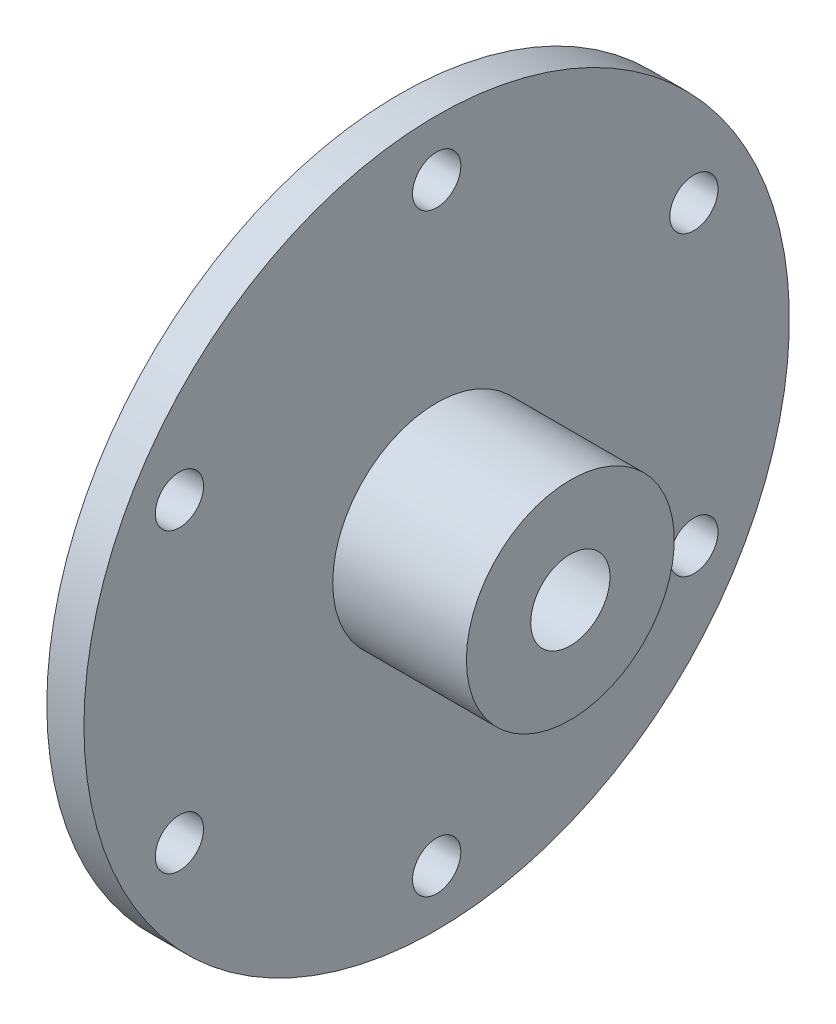
ISO-10303-21;
HEADER;
FILE_DESCRIPTION(('STEP AP214'),'2;1');
FILE_NAME('part.step','',(''),(''),'','','');
FILE_SCHEMA(('AUTOMOTIVE_DESIGN { 1 0 10303 214 1 1 1 1 }'));
ENDSEC;
DATA;
#1=APPLICATION_CONTEXT('core data for automotive mechanical design processes');
#2=APPLICATION_PROTOCOL_DEFINITION('international standard','automotive_design',2000,#1);
#3=PRODUCT_CONTEXT('',#1,'mechanical');
#4=PRODUCT('Part','Part','',(#3));
#5=PRODUCT_RELATED_PRODUCT_CATEGORY('part','',(#4));
#6=PRODUCT_DEFINITION_FORMATION('','',#4);
#7=PRODUCT_DEFINITION_CONTEXT('part definition',#1,'design');
#8=PRODUCT_DEFINITION('design','',#6,#7);
#9=PRODUCT_DEFINITION_SHAPE('','',#8);
#10=(LENGTH_UNIT() NAMED_UNIT(*) SI_UNIT(.MILLI.,.METRE.));
#11=(NAMED_UNIT(*) PLANE_ANGLE_UNIT() SI_UNIT($,.RADIAN.));
#12=(NAMED_UNIT(*) SI_UNIT($,.STERADIAN.) SOLID_ANGLE_UNIT());
#13=UNCERTAINTY_MEASURE_WITH_UNIT(LENGTH_MEASURE(1.E-05),#10,'distance_accuracy_value','');
#14=(GEOMETRIC_REPRESENTATION_CONTEXT(3) GLOBAL_UNCERTAINTY_ASSIGNED_CONTEXT((#13)) GLOBAL_UNIT_ASSIGNED_CONTEXT((#10,
#11,#12)) REPRESENTATION_CONTEXT('',''));
#15=CARTESIAN_POINT('',(0.,0.,0.));
#16=DIRECTION('',(0.,0.,1.));
#17=DIRECTION('',(1.,0.,0.));
#18=AXIS2_PLACEMENT_3D('',#15,#16,#17);
#19=CARTESIAN_POINT('',(-20.0253164556962,0.,0.));
#20=DIRECTION('',(1.,0.,0.));
#21=DIRECTION('',(0.,0.,-1.));
#22=AXIS2_PLACEMENT_3D('',#19,#20,#21);
#23=PLANE('',#22);
#24=CARTESIAN_POINT('',(-20.0253164556962,0.,0.));
#25=DIRECTION('',(-1.,0.,0.));
#26=DIRECTION('',(0.,0.,1.));
#27=AXIS2_PLACEMENT_3D('',#24,#25,#26);
#28=CIRCLE('',#27,13.);
#29=CARTESIAN_POINT('',(-20.0253164556962,0.,13.));
#30=VERTEX_POINT('',#29);
#31=EDGE_CURVE('E99',#30,#30,#28,.T.);
#32=ORIENTED_EDGE('',*,*,#31,.F.);
#33=EDGE_LOOP('',(#32));
#34=FACE_BOUND('',#33,.T.);
#35=CARTESIAN_POINT('',(-20.0253164556962,0.,0.));
#36=DIRECTION('',(-1.,0.,0.));
#37=DIRECTION('',(0.,0.,1.));
#38=AXIS2_PLACEMENT_3D('',#35,#36,#37);
#39=CIRCLE('',#38,35.);
#40=CARTESIAN_POINT('',(-20.0253164556962,0.,35.));
#41=VERTEX_POINT('',#40);
#42=EDGE_CURVE('E10',#41,#41,#39,.T.);
#43=ORIENTED_EDGE('',*,*,#42,.T.);
#44=EDGE_LOOP('',(#43));
#45=FACE_BOUND('',#44,.T.);
#46=ADVANCED_FACE('F41',(#34,#45),#23,.F.);
#47=CARTESIAN_POINT('',(-20.0253164556962,0.,0.));
#48=DIRECTION('',(-1.,0.,0.));
#49=DIRECTION('',(0.,0.,1.));
#50=AXIS2_PLACEMENT_3D('',#47,#48,#49);
#51=CYLINDRICAL_SURFACE('',#50,35.);
#52=ORIENTED_EDGE('',*,*,#42,.F.);
#53=EDGE_LOOP('',(#52));
#54=FACE_BOUND('',#53,.T.);
#55=CARTESIAN_POINT('',(-15.0253164556962,0.,0.));
#56=DIRECTION('',(-1.,0.,0.));
#57=DIRECTION('',(0.,0.,1.));
#58=AXIS2_PLACEMENT_3D('',#55,#56,#57);
#59=CIRCLE('',#58,35.);
#60=CARTESIAN_POINT('',(-15.0253164556962,0.,35.));
#61=VERTEX_POINT('',#60);
#62=EDGE_CURVE('E48',#61,#61,#59,.T.);
#63=ORIENTED_EDGE('',*,*,#62,.T.);
#64=EDGE_LOOP('',(#63));
#65=FACE_BOUND('',#64,.T.);
#66=ADVANCED_FACE('F149',(#54,#65),#51,.T.);
#67=CARTESIAN_POINT('',(-15.0253164556962,35.,0.));
#68=DIRECTION('',(1.,0.,0.));
#69=DIRECTION('',(0.,0.,-1.));
#70=AXIS2_PLACEMENT_3D('',#67,#68,#69);
#71=PLANE('',#70);
#72=CARTESIAN_POINT('',(-15.0253164556962,20.0000000000004,34.6410161513773));
#73=DIRECTION('',(1.,0.,0.));
#74=DIRECTION('',(0.,0.,-1.));
#75=AXIS2_PLACEMENT_3D('',#72,#73,#74);
#76=CIRCLE('',#75,3.24999999999999);
#77=CARTESIAN_POINT('',(-15.0253164556962,20.0000000000004,31.3910161513773));
#78=VERTEX_POINT('',#77);
#79=EDGE_CURVE('E44',#78,#78,#76,.T.);
#80=ORIENTED_EDGE('',*,*,#79,.T.);
#81=EDGE_LOOP('',(#80));
#82=FACE_BOUND('',#81,.T.);
#83=CARTESIAN_POINT('',(-15.0253164556962,-19.9999999999997,34.6410161513777));
#84=DIRECTION('',(1.,0.,0.));
#85=DIRECTION('',(0.,0.,-1.));
#86=AXIS2_PLACEMENT_3D('',#83,#84,#85);
#87=CIRCLE('',#86,3.24999999999999);
#88=CARTESIAN_POINT('',(-15.0253164556962,-19.9999999999997,31.3910161513777));
#89=VERTEX_POINT('',#88);
#90=EDGE_CURVE('E78',#89,#89,#87,.T.);
#91=ORIENTED_EDGE('',*,*,#90,.T.);
#92=EDGE_LOOP('',(#91));
#93=FACE_BOUND('',#92,.T.);
#94=CARTESIAN_POINT('',(-15.0253164556962,-40.,0.));
#95=DIRECTION('',(1.,0.,0.));
#96=DIRECTION('',(0.,0.,-1.));
#97=AXIS2_PLACEMENT_3D('',#94,#95,#96);
#98=CIRCLE('',#97,3.25);
#99=CARTESIAN_POINT('',(-15.0253164556962,-40.,-3.25));
#100=VERTEX_POINT('',#99);
#101=EDGE_CURVE('E75',#100,#100,#98,.T.);
#102=ORIENTED_EDGE('',*,*,#101,.T.);
#103=EDGE_LOOP('',(#102));
#104=FACE_BOUND('',#103,.T.);
#105=CARTESIAN_POINT('',(-15.0253164556962,-20.0000000000002,-34.6410161513775));
#106=DIRECTION('',(1.,0.,0.));
#107=DIRECTION('',(0.,0.,-1.));
#108=AXIS2_PLACEMENT_3D('',#105,#106,#107);
#109=CIRCLE('',#108,3.24999999999999);
#110=CARTESIAN_POINT('',(-15.0253164556962,-20.0000000000002,-37.8910161513775));
#111=VERTEX_POINT('',#110);
#112=EDGE_CURVE('E71',#111,#111,#109,.T.);
#113=ORIENTED_EDGE('',*,*,#112,.T.);
#114=EDGE_LOOP('',(#113));
#115=FACE_BOUND('',#114,.T.);
#116=CARTESIAN_POINT('',(-15.0253164556962,19.9999999999999,-34.6410161513776));
#117=DIRECTION('',(1.,0.,0.));
#118=DIRECTION('',(0.,0.,-1.));
#119=AXIS2_PLACEMENT_3D('',#116,#117,#118);
#120=CIRCLE('',#119,3.24999999999999);
#121=CARTESIAN_POINT('',(-15.0253164556962,19.9999999999999,-37.8910161513776));
#122=VERTEX_POINT('',#121);
#123=EDGE_CURVE('E66',#122,#122,#120,.T.);
#124=ORIENTED_EDGE('',*,*,#123,.T.);
#125=EDGE_LOOP('',(#124));
#126=FACE_BOUND('',#125,.T.);
#127=CARTESIAN_POINT('',(-15.0253164556962,40.,0.));
#128=DIRECTION('',(1.,0.,0.));
#129=DIRECTION('',(0.,0.,-1.));
#130=AXIS2_PLACEMENT_3D('',#127,#128,#129);
#131=CIRCLE('',#130,3.25);
#132=CARTESIAN_POINT('',(-15.0253164556962,40.,-3.25));
#133=VERTEX_POINT('',#132);
#134=EDGE_CURVE('E62',#133,#133,#131,.T.);
#135=ORIENTED_EDGE('',*,*,#134,.T.);
#136=EDGE_LOOP('',(#135));
#137=FACE_BOUND('',#136,.T.);
#138=ORIENTED_EDGE('',*,*,#62,.F.);
#139=EDGE_LOOP('',(#138));
#140=FACE_BOUND('',#139,.T.);
#141=CARTESIAN_POINT('',(-15.0253164556962,0.,0.));
#142=DIRECTION('',(-1.,0.,0.));
#143=DIRECTION('',(0.,0.,1.));
#144=AXIS2_PLACEMENT_3D('',#141,#142,#143);
#145=CIRCLE('',#144,47.5);
#146=CARTESIAN_POINT('',(-15.0253164556962,0.,47.5));
#147=VERTEX_POINT('',#146);
#148=EDGE_CURVE('E53',#147,#147,#145,.T.);
#149=ORIENTED_EDGE('',*,*,#148,.T.);
#150=EDGE_LOOP('',(#149));
#151=FACE_BOUND('',#150,.T.);
#152=ADVANCED_FACE('F117',(#82,#93,#104,#115,#126,#137,#140,#151),#71,.F.);
#153=CARTESIAN_POINT('',(-20.0253164556962,0.,0.));
#154=DIRECTION('',(-1.,0.,0.));
#155=DIRECTION('',(0.,0.,1.));
#156=AXIS2_PLACEMENT_3D('',#153,#154,#155);
#157=CYLINDRICAL_SURFACE('',#156,47.5);
#158=ORIENTED_EDGE('',*,*,#148,.F.);
#159=EDGE_LOOP('',(#158));
#160=FACE_BOUND('',#159,.T.);
#161=CARTESIAN_POINT('',(-10.0253164556962,0.,0.));
#162=DIRECTION('',(-1.,0.,0.));
#163=DIRECTION('',(0.,0.,1.));
#164=AXIS2_PLACEMENT_3D('',#161,#162,#163);
#165=CIRCLE('',#164,47.5);
#166=CARTESIAN_POINT('',(-10.0253164556962,0.,47.5));
#167=VERTEX_POINT('',#166);
#168=EDGE_CURVE('E112',#167,#167,#165,.T.);
#169=ORIENTED_EDGE('',*,*,#168,.T.);
#170=EDGE_LOOP('',(#169));
#171=FACE_BOUND('',#170,.T.);
#172=ADVANCED_FACE('F119',(#160,#171),#157,.T.);
#173=CARTESIAN_POINT('',(-10.0253164556962,47.5,0.));
#174=DIRECTION('',(-1.,0.,0.));
#175=DIRECTION('',(0.,0.,1.));
#176=AXIS2_PLACEMENT_3D('',#173,#174,#175);
#177=PLANE('',#176);
#178=CARTESIAN_POINT('',(-10.0253164556962,20.0000000000004,34.6410161513773));
#179=DIRECTION('',(-1.,0.,0.));
#180=DIRECTION('',(0.,0.,1.));
#181=AXIS2_PLACEMENT_3D('',#178,#179,#180);
#182=CIRCLE('',#181,3.24999999999999);
#183=CARTESIAN_POINT('',(-10.0253164556962,20.0000000000004,37.8910161513773));
#184=VERTEX_POINT('',#183);
#185=EDGE_CURVE('E80',#184,#184,#182,.T.);
#186=ORIENTED_EDGE('',*,*,#185,.T.);
#187=EDGE_LOOP('',(#186));
#188=FACE_BOUND('',#187,.T.);
#189=CARTESIAN_POINT('',(-10.0253164556962,-19.9999999999997,34.6410161513777));
#190=DIRECTION('',(-1.,0.,0.));
#191=DIRECTION('',(0.,0.,1.));
#192=AXIS2_PLACEMENT_3D('',#189,#190,#191);
#193=CIRCLE('',#192,3.24999999999999);
#194=CARTESIAN_POINT('',(-10.0253164556962,-19.9999999999997,37.8910161513777));
#195=VERTEX_POINT('',#194);
#196=EDGE_CURVE('E77',#195,#195,#193,.T.);
#197=ORIENTED_EDGE('',*,*,#196,.T.);
#198=EDGE_LOOP('',(#197));
#199=FACE_BOUND('',#198,.T.);
#200=CARTESIAN_POINT('',(-10.0253164556962,-40.,0.));
#201=DIRECTION('',(-1.,0.,0.));
#202=DIRECTION('',(0.,0.,1.));
#203=AXIS2_PLACEMENT_3D('',#200,#201,#202);
#204=CIRCLE('',#203,3.25);
#205=CARTESIAN_POINT('',(-10.0253164556962,-40.,3.25));
#206=VERTEX_POINT('',#205);
#207=EDGE_CURVE('E74',#206,#206,#204,.T.);
#208=ORIENTED_EDGE('',*,*,#207,.T.);
#209=EDGE_LOOP('',(#208));
#210=FACE_BOUND('',#209,.T.);
#211=CARTESIAN_POINT('',(-10.0253164556962,-20.0000000000002,-34.6410161513775));
#212=DIRECTION('',(-1.,0.,0.));
#213=DIRECTION('',(0.,0.,1.));
#214=AXIS2_PLACEMENT_3D('',#211,#212,#213);
#215=CIRCLE('',#214,3.24999999999999);
#216=CARTESIAN_POINT('',(-10.0253164556962,-20.0000000000002,-31.3910161513775));
#217=VERTEX_POINT('',#216);
#218=EDGE_CURVE('E70',#217,#217,#215,.T.);
#219=ORIENTED_EDGE('',*,*,#218,.T.);
#220=EDGE_LOOP('',(#219));
#221=FACE_BOUND('',#220,.T.);
#222=CARTESIAN_POINT('',(-10.0253164556962,19.9999999999999,-34.6410161513776));
#223=DIRECTION('',(-1.,0.,0.));
#224=DIRECTION('',(0.,0.,1.));
#225=AXIS2_PLACEMENT_3D('',#222,#223,#224);
#226=CIRCLE('',#225,3.24999999999999);
#227=CARTESIAN_POINT('',(-10.0253164556962,19.9999999999999,-31.3910161513776));
#228=VERTEX_POINT('',#227);
#229=EDGE_CURVE('E67',#228,#228,#226,.T.);
#230=ORIENTED_EDGE('',*,*,#229,.T.);
#231=EDGE_LOOP('',(#230));
#232=FACE_BOUND('',#231,.T.);
#233=CARTESIAN_POINT('',(-10.0253164556962,40.,0.));
#234=DIRECTION('',(-1.,0.,0.));
#235=DIRECTION('',(0.,0.,1.));
#236=AXIS2_PLACEMENT_3D('',#233,#234,#235);
#237=CIRCLE('',#236,3.25);
#238=CARTESIAN_POINT('',(-10.0253164556962,40.,3.25));
#239=VERTEX_POINT('',#238);
#240=EDGE_CURVE('E65',#239,#239,#237,.T.);
#241=ORIENTED_EDGE('',*,*,#240,.T.);
#242=EDGE_LOOP('',(#241));
#243=FACE_BOUND('',#242,.T.);
#244=ORIENTED_EDGE('',*,*,#168,.F.);
#245=EDGE_LOOP('',(#244));
#246=FACE_BOUND('',#245,.T.);
#247=CARTESIAN_POINT('',(-10.0253164556962,0.,0.));
#248=DIRECTION('',(-1.,0.,0.));
#249=DIRECTION('',(0.,0.,1.));
#250=AXIS2_PLACEMENT_3D('',#247,#248,#249);
#251=CIRCLE('',#250,14.);
#252=CARTESIAN_POINT('',(-10.0253164556962,0.,14.));
#253=VERTEX_POINT('',#252);
#254=EDGE_CURVE('E109',#253,#253,#251,.T.);
#255=ORIENTED_EDGE('',*,*,#254,.T.);
#256=EDGE_LOOP('',(#255));
#257=FACE_BOUND('',#256,.T.);
#258=ADVANCED_FACE('F122',(#188,#199,#210,#221,#232,#243,#246,#257),#177,.F.);
#259=CARTESIAN_POINT('',(-20.0253164556962,0.,0.));
#260=DIRECTION('',(-1.,0.,0.));
#261=DIRECTION('',(0.,0.,1.));
#262=AXIS2_PLACEMENT_3D('',#259,#260,#261);
#263=CYLINDRICAL_SURFACE('',#262,14.);
#264=ORIENTED_EDGE('',*,*,#254,.F.);
#265=EDGE_LOOP('',(#264));
#266=FACE_BOUND('',#265,.T.);
#267=CARTESIAN_POINT('',(7.9746835443038,0.,0.));
#268=DIRECTION('',(-1.,0.,0.));
#269=DIRECTION('',(0.,0.,1.));
#270=AXIS2_PLACEMENT_3D('',#267,#268,#269);
#271=CIRCLE('',#270,14.);
#272=CARTESIAN_POINT('',(7.9746835443038,0.,14.));
#273=VERTEX_POINT('',#272);
#274=EDGE_CURVE('E60',#273,#273,#271,.T.);
#275=ORIENTED_EDGE('',*,*,#274,.T.);
#276=EDGE_LOOP('',(#275));
#277=FACE_BOUND('',#276,.T.);
#278=ADVANCED_FACE('F128',(#266,#277),#263,.T.);
#279=CARTESIAN_POINT('',(7.9746835443038,14.,0.));
#280=DIRECTION('',(-1.,0.,0.));
#281=DIRECTION('',(0.,0.,1.));
#282=AXIS2_PLACEMENT_3D('',#279,#280,#281);
#283=PLANE('',#282);
#284=CARTESIAN_POINT('',(7.9746835443038,0.,0.));
#285=DIRECTION('',(-1.,0.,0.));
#286=DIRECTION('',(0.,0.,1.));
#287=AXIS2_PLACEMENT_3D('',#284,#285,#286);
#288=CIRCLE('',#287,5.33572051764947);
#289=CARTESIAN_POINT('',(7.9746835443038,0.,5.33572051764947));
#290=VERTEX_POINT('',#289);
#291=EDGE_CURVE('E57',#290,#290,#288,.T.);
#292=ORIENTED_EDGE('',*,*,#291,.T.);
#293=EDGE_LOOP('',(#292));
#294=FACE_BOUND('',#293,.T.);
#295=ORIENTED_EDGE('',*,*,#274,.F.);
#296=EDGE_LOOP('',(#295));
#297=FACE_BOUND('',#296,.T.);
#298=ADVANCED_FACE('F134',(#294,#297),#283,.F.);
#299=CARTESIAN_POINT('',(6.97468354430379,0.,0.));
#300=DIRECTION('',(-1.,0.,0.));
#301=DIRECTION('',(0.,0.,1.));
#302=AXIS2_PLACEMENT_3D('',#299,#300,#301);
#303=CONICAL_SURFACE('',#302,6.99999999999999,1.02974425867665);
#304=CARTESIAN_POINT('',(6.97468354430379,0.,0.));
#305=DIRECTION('',(-1.,0.,0.));
#306=DIRECTION('',(0.,0.,1.));
#307=AXIS2_PLACEMENT_3D('',#304,#305,#306);
#308=CIRCLE('',#307,6.99999999999999);
#309=CARTESIAN_POINT('',(6.97468354430379,0.,6.99999999999999));
#310=VERTEX_POINT('',#309);
#311=EDGE_CURVE('E61',#310,#310,#308,.T.);
#312=ORIENTED_EDGE('',*,*,#311,.T.);
#313=EDGE_LOOP('',(#312));
#314=FACE_BOUND('',#313,.T.);
#315=ORIENTED_EDGE('',*,*,#291,.F.);
#316=EDGE_LOOP('',(#315));
#317=FACE_BOUND('',#316,.T.);
#318=ADVANCED_FACE('F139',(#314,#317),#303,.F.);
#319=CARTESIAN_POINT('',(-20.0253164556962,0.,0.));
#320=DIRECTION('',(-1.,0.,0.));
#321=DIRECTION('',(0.,0.,1.));
#322=AXIS2_PLACEMENT_3D('',#319,#320,#321);
#323=CYLINDRICAL_SURFACE('',#322,6.99999999999999);
#324=ORIENTED_EDGE('',*,*,#311,.F.);
#325=EDGE_LOOP('',(#324));
#326=FACE_BOUND('',#325,.T.);
#327=CARTESIAN_POINT('',(-14.0253164556962,0.,0.));
#328=DIRECTION('',(-1.,0.,0.));
#329=DIRECTION('',(0.,0.,1.));
#330=AXIS2_PLACEMENT_3D('',#327,#328,#329);
#331=CIRCLE('',#330,7.);
#332=CARTESIAN_POINT('',(-14.0253164556962,0.,7.));
#333=VERTEX_POINT('',#332);
#334=EDGE_CURVE('E102',#333,#333,#331,.T.);
#335=ORIENTED_EDGE('',*,*,#334,.T.);
#336=EDGE_LOOP('',(#335));
#337=FACE_BOUND('',#336,.T.);
#338=ADVANCED_FACE('F145',(#326,#337),#323,.F.);
#339=CARTESIAN_POINT('',(-20.0253164556962,0.,0.));
#340=DIRECTION('',(-1.,0.,0.));
#341=DIRECTION('',(0.,0.,1.));
#342=AXIS2_PLACEMENT_3D('',#339,#340,#341);
#343=CONICAL_SURFACE('',#342,13.,0.785398163397449);
#344=ORIENTED_EDGE('',*,*,#334,.F.);
#345=EDGE_LOOP('',(#344));
#346=FACE_BOUND('',#345,.T.);
#347=ORIENTED_EDGE('',*,*,#31,.T.);
#348=EDGE_LOOP('',(#347));
#349=FACE_BOUND('',#348,.T.);
#350=ADVANCED_FACE('F157',(#346,#349),#343,.F.);
#351=CARTESIAN_POINT('',(-20.0253164556962,40.,0.));
#352=DIRECTION('',(-1.,0.,0.));
#353=DIRECTION('',(0.,0.,1.));
#354=AXIS2_PLACEMENT_3D('',#351,#352,#353);
#355=CYLINDRICAL_SURFACE('',#354,3.25);
#356=ORIENTED_EDGE('',*,*,#134,.F.);
#357=EDGE_LOOP('',(#356));
#358=FACE_BOUND('',#357,.T.);
#359=ORIENTED_EDGE('',*,*,#240,.F.);
#360=EDGE_LOOP('',(#359));
#361=FACE_BOUND('',#360,.T.);
#362=ADVANCED_FACE('F159',(#358,#361),#355,.F.);
#363=CARTESIAN_POINT('',(-20.0253164556962,19.9999999999999,-34.6410161513776));
#364=DIRECTION('',(-1.,0.,0.));
#365=DIRECTION('',(0.,0.,1.));
#366=AXIS2_PLACEMENT_3D('',#363,#364,#365);
#367=CYLINDRICAL_SURFACE('',#366,3.24999999999999);
#368=ORIENTED_EDGE('',*,*,#229,.F.);
#369=EDGE_LOOP('',(#368));
#370=FACE_BOUND('',#369,.T.);
#371=ORIENTED_EDGE('',*,*,#123,.F.);
#372=EDGE_LOOP('',(#371));
#373=FACE_BOUND('',#372,.T.);
#374=ADVANCED_FACE('F166',(#370,#373),#367,.F.);
#375=CARTESIAN_POINT('',(-20.0253164556962,-20.0000000000002,-34.6410161513775));
#376=DIRECTION('',(-1.,0.,0.));
#377=DIRECTION('',(0.,0.,1.));
#378=AXIS2_PLACEMENT_3D('',#375,#376,#377);
#379=CYLINDRICAL_SURFACE('',#378,3.24999999999999);
#380=ORIENTED_EDGE('',*,*,#112,.F.);
#381=EDGE_LOOP('',(#380));
#382=FACE_BOUND('',#381,.T.);
#383=ORIENTED_EDGE('',*,*,#218,.F.);
#384=EDGE_LOOP('',(#383));
#385=FACE_BOUND('',#384,.T.);
#386=ADVANCED_FACE('F175',(#382,#385),#379,.F.);
#387=CARTESIAN_POINT('',(-20.0253164556962,-40.,0.));
#388=DIRECTION('',(-1.,0.,0.));
#389=DIRECTION('',(0.,0.,1.));
#390=AXIS2_PLACEMENT_3D('',#387,#388,#389);
#391=CYLINDRICAL_SURFACE('',#390,3.25);
#392=ORIENTED_EDGE('',*,*,#101,.F.);
#393=EDGE_LOOP('',(#392));
#394=FACE_BOUND('',#393,.T.);
#395=ORIENTED_EDGE('',*,*,#207,.F.);
#396=EDGE_LOOP('',(#395));
#397=FACE_BOUND('',#396,.T.);
#398=ADVANCED_FACE('F179',(#394,#397),#391,.F.);
#399=CARTESIAN_POINT('',(-20.0253164556962,-19.9999999999997,34.6410161513777));
#400=DIRECTION('',(-1.,0.,0.));
#401=DIRECTION('',(0.,0.,1.));
#402=AXIS2_PLACEMENT_3D('',#399,#400,#401);
#403=CYLINDRICAL_SURFACE('',#402,3.24999999999999);
#404=ORIENTED_EDGE('',*,*,#90,.F.);
#405=EDGE_LOOP('',(#404));
#406=FACE_BOUND('',#405,.T.);
#407=ORIENTED_EDGE('',*,*,#196,.F.);
#408=EDGE_LOOP('',(#407));
#409=FACE_BOUND('',#408,.T.);
#410=ADVANCED_FACE('F183',(#406,#409),#403,.F.);
#411=CARTESIAN_POINT('',(-20.0253164556962,20.0000000000004,34.6410161513773));
#412=DIRECTION('',(-1.,0.,0.));
#413=DIRECTION('',(0.,0.,1.));
#414=AXIS2_PLACEMENT_3D('',#411,#412,#413);
#415=CYLINDRICAL_SURFACE('',#414,3.24999999999999);
#416=ORIENTED_EDGE('',*,*,#79,.F.);
#417=EDGE_LOOP('',(#416));
#418=FACE_BOUND('',#417,.T.);
#419=ORIENTED_EDGE('',*,*,#185,.F.);
#420=EDGE_LOOP('',(#419));
#421=FACE_BOUND('',#420,.T.);
#422=ADVANCED_FACE('F187',(#418,#421),#415,.F.);
#423=CLOSED_SHELL('',(#46,#66,#152,#172,#258,#278,#298,#318,#338,#350,#362,#374,#386,#398,#410,#422));
#424=MANIFOLD_SOLID_BREP('B2',#423);
#425=ADVANCED_BREP_SHAPE_REPRESENTATION('',(#18,#424),#14);
#426=SHAPE_DEFINITION_REPRESENTATION(#9,#425);
ENDSEC;
END-ISO-10303-21;
